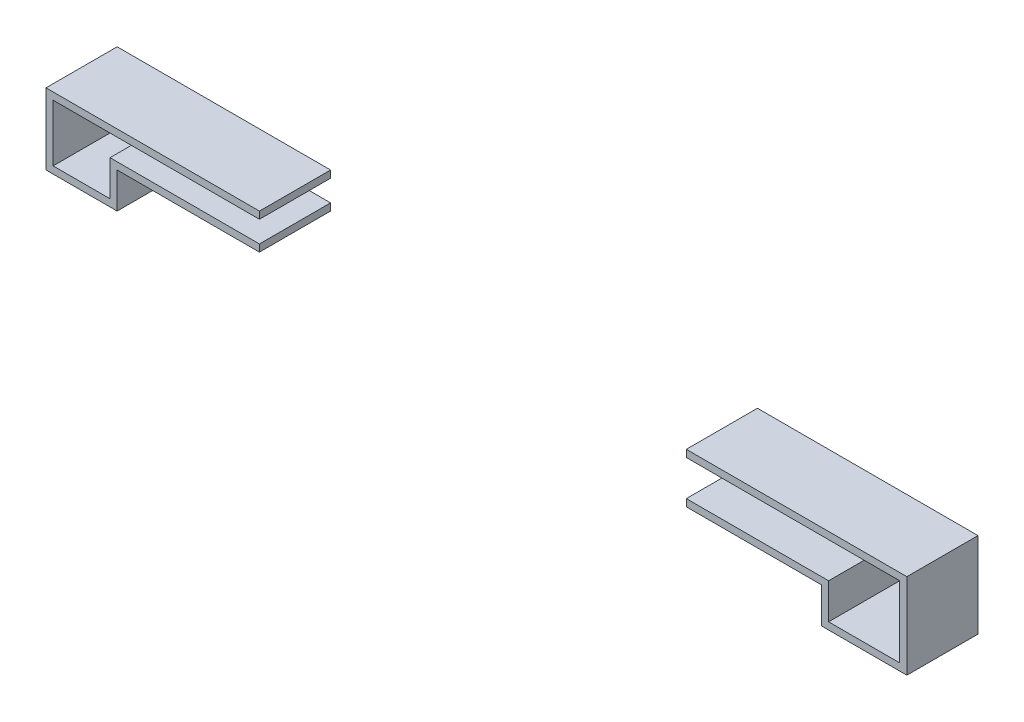
ISO-10303-21;
HEADER;
FILE_DESCRIPTION(('STEP AP214'),'2;1');
FILE_NAME('part.step','',(''),(''),'','','');
FILE_SCHEMA(('AUTOMOTIVE_DESIGN { 1 0 10303 214 1 1 1 1 }'));
ENDSEC;
DATA;
#1=APPLICATION_CONTEXT('core data for automotive mechanical design processes');
#2=APPLICATION_PROTOCOL_DEFINITION('international standard','automotive_design',2000,#1);
#3=PRODUCT_CONTEXT('',#1,'mechanical');
#4=PRODUCT('Part','Part','',(#3));
#5=PRODUCT_RELATED_PRODUCT_CATEGORY('part','',(#4));
#6=PRODUCT_DEFINITION_FORMATION('','',#4);
#7=PRODUCT_DEFINITION_CONTEXT('part definition',#1,'design');
#8=PRODUCT_DEFINITION('design','',#6,#7);
#9=PRODUCT_DEFINITION_SHAPE('','',#8);
#10=(LENGTH_UNIT() NAMED_UNIT(*) SI_UNIT(.MILLI.,.METRE.));
#11=(NAMED_UNIT(*) PLANE_ANGLE_UNIT() SI_UNIT($,.RADIAN.));
#12=(NAMED_UNIT(*) SI_UNIT($,.STERADIAN.) SOLID_ANGLE_UNIT());
#13=UNCERTAINTY_MEASURE_WITH_UNIT(LENGTH_MEASURE(1.E-05),#10,'distance_accuracy_value','');
#14=(GEOMETRIC_REPRESENTATION_CONTEXT(3) GLOBAL_UNCERTAINTY_ASSIGNED_CONTEXT((#13)) GLOBAL_UNIT_ASSIGNED_CONTEXT((#10,
#11,#12)) REPRESENTATION_CONTEXT('',''));
#15=CARTESIAN_POINT('',(0.,0.,0.));
#16=DIRECTION('',(0.,0.,1.));
#17=DIRECTION('',(1.,0.,0.));
#18=AXIS2_PLACEMENT_3D('',#15,#16,#17);
#19=CARTESIAN_POINT('',(6.,1.1,1.));
#20=DIRECTION('',(0.,-1.,0.));
#21=DIRECTION('',(1.,0.,0.));
#22=AXIS2_PLACEMENT_3D('',#19,#20,#21);
#23=PLANE('',#22);
#24=DIRECTION('',(-1.,0.,0.));
#25=VECTOR('',#24,1.);
#26=CARTESIAN_POINT('',(6.,1.1,0.));
#27=LINE('',#26,#25);
#28=CARTESIAN_POINT('',(6.1,1.1,0.));
#29=VERTEX_POINT('',#28);
#30=CARTESIAN_POINT('',(3.,1.1,0.));
#31=VERTEX_POINT('',#30);
#32=EDGE_CURVE('E178',#29,#31,#27,.T.);
#33=ORIENTED_EDGE('',*,*,#32,.T.);
#34=DIRECTION('',(0.,0.,-1.));
#35=VECTOR('',#34,1.);
#36=CARTESIAN_POINT('',(3.,1.1,1.));
#37=LINE('',#36,#35);
#38=CARTESIAN_POINT('',(3.,1.1,1.));
#39=VERTEX_POINT('',#38);
#40=EDGE_CURVE('E12',#39,#31,#37,.T.);
#41=ORIENTED_EDGE('',*,*,#40,.F.);
#42=DIRECTION('',(-1.,0.,0.));
#43=VECTOR('',#42,1.);
#44=CARTESIAN_POINT('',(6.,1.1,1.));
#45=LINE('',#44,#43);
#46=CARTESIAN_POINT('',(6.1,1.1,1.));
#47=VERTEX_POINT('',#46);
#48=EDGE_CURVE('E122',#47,#39,#45,.T.);
#49=ORIENTED_EDGE('',*,*,#48,.F.);
#50=DIRECTION('',(0.,0.,-1.));
#51=VECTOR('',#50,1.);
#52=CARTESIAN_POINT('',(6.1,1.1,1.));
#53=LINE('',#52,#51);
#54=EDGE_CURVE('E174',#47,#29,#53,.T.);
#55=ORIENTED_EDGE('',*,*,#54,.T.);
#56=EDGE_LOOP('',(#33,#41,#49,#55));
#57=FACE_BOUND('',#56,.T.);
#58=ADVANCED_FACE('F53',(#57),#23,.F.);
#59=CARTESIAN_POINT('',(3.,1.,1.));
#60=DIRECTION('',(-1.,0.,0.));
#61=DIRECTION('',(0.,0.,1.));
#62=AXIS2_PLACEMENT_3D('',#59,#60,#61);
#63=PLANE('',#62);
#64=DIRECTION('',(0.,1.,0.));
#65=VECTOR('',#64,1.);
#66=CARTESIAN_POINT('',(3.,1.,0.));
#67=LINE('',#66,#65);
#68=CARTESIAN_POINT('',(3.,1.,0.));
#69=VERTEX_POINT('',#68);
#70=EDGE_CURVE('E182',#69,#31,#67,.T.);
#71=ORIENTED_EDGE('',*,*,#70,.F.);
#72=DIRECTION('',(0.,0.,-1.));
#73=VECTOR('',#72,1.);
#74=CARTESIAN_POINT('',(3.,1.,1.));
#75=LINE('',#74,#73);
#76=CARTESIAN_POINT('',(3.,1.,1.));
#77=VERTEX_POINT('',#76);
#78=EDGE_CURVE('E62',#77,#69,#75,.T.);
#79=ORIENTED_EDGE('',*,*,#78,.F.);
#80=DIRECTION('',(0.,1.,0.));
#81=VECTOR('',#80,1.);
#82=CARTESIAN_POINT('',(3.,1.,1.));
#83=LINE('',#82,#81);
#84=EDGE_CURVE('E265',#77,#39,#83,.T.);
#85=ORIENTED_EDGE('',*,*,#84,.T.);
#86=ORIENTED_EDGE('',*,*,#40,.T.);
#87=EDGE_LOOP('',(#71,#79,#85,#86));
#88=FACE_BOUND('',#87,.T.);
#89=ADVANCED_FACE('F252',(#88),#63,.T.);
#90=CARTESIAN_POINT('',(6.,1.,1.));
#91=DIRECTION('',(0.,-1.,0.));
#92=DIRECTION('',(1.,0.,0.));
#93=AXIS2_PLACEMENT_3D('',#90,#91,#92);
#94=PLANE('',#93);
#95=DIRECTION('',(-1.,0.,0.));
#96=VECTOR('',#95,1.);
#97=CARTESIAN_POINT('',(6.,1.,0.));
#98=LINE('',#97,#96);
#99=CARTESIAN_POINT('',(6.,1.,0.));
#100=VERTEX_POINT('',#99);
#101=EDGE_CURVE('E186',#100,#69,#98,.T.);
#102=ORIENTED_EDGE('',*,*,#101,.F.);
#103=DIRECTION('',(0.,0.,-1.));
#104=VECTOR('',#103,1.);
#105=CARTESIAN_POINT('',(6.,1.,1.));
#106=LINE('',#105,#104);
#107=CARTESIAN_POINT('',(6.,1.,1.));
#108=VERTEX_POINT('',#107);
#109=EDGE_CURVE('E240',#108,#100,#106,.T.);
#110=ORIENTED_EDGE('',*,*,#109,.F.);
#111=DIRECTION('',(-1.,0.,0.));
#112=VECTOR('',#111,1.);
#113=CARTESIAN_POINT('',(6.,1.,1.));
#114=LINE('',#113,#112);
#115=EDGE_CURVE('E249',#108,#77,#114,.T.);
#116=ORIENTED_EDGE('',*,*,#115,.T.);
#117=ORIENTED_EDGE('',*,*,#78,.T.);
#118=EDGE_LOOP('',(#102,#110,#116,#117));
#119=FACE_BOUND('',#118,.T.);
#120=ADVANCED_FACE('F247',(#119),#94,.T.);
#121=CARTESIAN_POINT('',(6.,0.,1.));
#122=DIRECTION('',(-1.,0.,0.));
#123=DIRECTION('',(0.,0.,1.));
#124=AXIS2_PLACEMENT_3D('',#121,#122,#123);
#125=PLANE('',#124);
#126=DIRECTION('',(0.,1.,0.));
#127=VECTOR('',#126,1.);
#128=CARTESIAN_POINT('',(6.,0.,0.));
#129=LINE('',#128,#127);
#130=CARTESIAN_POINT('',(6.,0.,0.));
#131=VERTEX_POINT('',#130);
#132=EDGE_CURVE('E190',#131,#100,#129,.T.);
#133=ORIENTED_EDGE('',*,*,#132,.F.);
#134=DIRECTION('',(0.,0.,-1.));
#135=VECTOR('',#134,1.);
#136=CARTESIAN_POINT('',(6.,0.,1.));
#137=LINE('',#136,#135);
#138=CARTESIAN_POINT('',(6.,0.,1.));
#139=VERTEX_POINT('',#138);
#140=EDGE_CURVE('E237',#139,#131,#137,.T.);
#141=ORIENTED_EDGE('',*,*,#140,.F.);
#142=DIRECTION('',(0.,1.,0.));
#143=VECTOR('',#142,1.);
#144=CARTESIAN_POINT('',(6.,0.,1.));
#145=LINE('',#144,#143);
#146=EDGE_CURVE('E262',#139,#108,#145,.T.);
#147=ORIENTED_EDGE('',*,*,#146,.T.);
#148=ORIENTED_EDGE('',*,*,#109,.T.);
#149=EDGE_LOOP('',(#133,#141,#147,#148));
#150=FACE_BOUND('',#149,.T.);
#151=ADVANCED_FACE('F259',(#150),#125,.T.);
#152=CARTESIAN_POINT('',(5.,0.,1.));
#153=DIRECTION('',(0.,1.,0.));
#154=DIRECTION('',(0.,0.,1.));
#155=AXIS2_PLACEMENT_3D('',#152,#153,#154);
#156=PLANE('',#155);
#157=DIRECTION('',(1.,0.,0.));
#158=VECTOR('',#157,1.);
#159=CARTESIAN_POINT('',(5.,0.,0.));
#160=LINE('',#159,#158);
#161=CARTESIAN_POINT('',(5.,0.,0.));
#162=VERTEX_POINT('',#161);
#163=EDGE_CURVE('E194',#162,#131,#160,.T.);
#164=ORIENTED_EDGE('',*,*,#163,.F.);
#165=DIRECTION('',(0.,0.,-1.));
#166=VECTOR('',#165,1.);
#167=CARTESIAN_POINT('',(5.,0.,1.));
#168=LINE('',#167,#166);
#169=CARTESIAN_POINT('',(5.,0.,1.));
#170=VERTEX_POINT('',#169);
#171=EDGE_CURVE('E234',#170,#162,#168,.T.);
#172=ORIENTED_EDGE('',*,*,#171,.F.);
#173=DIRECTION('',(1.,0.,0.));
#174=VECTOR('',#173,1.);
#175=CARTESIAN_POINT('',(5.,0.,1.));
#176=LINE('',#175,#174);
#177=EDGE_CURVE('E270',#170,#139,#176,.T.);
#178=ORIENTED_EDGE('',*,*,#177,.T.);
#179=ORIENTED_EDGE('',*,*,#140,.T.);
#180=EDGE_LOOP('',(#164,#172,#178,#179));
#181=FACE_BOUND('',#180,.T.);
#182=ADVANCED_FACE('F382',(#181),#156,.T.);
#183=CARTESIAN_POINT('',(5.,0.,1.));
#184=DIRECTION('',(1.,0.,0.));
#185=DIRECTION('',(0.,0.,-1.));
#186=AXIS2_PLACEMENT_3D('',#183,#184,#185);
#187=PLANE('',#186);
#188=DIRECTION('',(0.,-1.,0.));
#189=VECTOR('',#188,1.);
#190=CARTESIAN_POINT('',(5.,0.,0.));
#191=LINE('',#190,#189);
#192=CARTESIAN_POINT('',(5.,0.500000000000001,0.));
#193=VERTEX_POINT('',#192);
#194=EDGE_CURVE('E198',#193,#162,#191,.T.);
#195=ORIENTED_EDGE('',*,*,#194,.F.);
#196=DIRECTION('',(0.,0.,-1.));
#197=VECTOR('',#196,1.);
#198=CARTESIAN_POINT('',(5.,0.500000000000001,1.));
#199=LINE('',#198,#197);
#200=CARTESIAN_POINT('',(5.,0.500000000000001,1.));
#201=VERTEX_POINT('',#200);
#202=EDGE_CURVE('E231',#201,#193,#199,.T.);
#203=ORIENTED_EDGE('',*,*,#202,.F.);
#204=DIRECTION('',(0.,-1.,0.));
#205=VECTOR('',#204,1.);
#206=CARTESIAN_POINT('',(5.,0.,1.));
#207=LINE('',#206,#205);
#208=EDGE_CURVE('E277',#201,#170,#207,.T.);
#209=ORIENTED_EDGE('',*,*,#208,.T.);
#210=ORIENTED_EDGE('',*,*,#171,.T.);
#211=EDGE_LOOP('',(#195,#203,#209,#210));
#212=FACE_BOUND('',#211,.T.);
#213=ADVANCED_FACE('F372',(#212),#187,.T.);
#214=CARTESIAN_POINT('',(5.,0.500000000000001,1.));
#215=DIRECTION('',(0.,1.,0.));
#216=DIRECTION('',(-1.,0.,0.));
#217=AXIS2_PLACEMENT_3D('',#214,#215,#216);
#218=PLANE('',#217);
#219=DIRECTION('',(1.,0.,0.));
#220=VECTOR('',#219,1.);
#221=CARTESIAN_POINT('',(5.,0.500000000000001,0.));
#222=LINE('',#221,#220);
#223=CARTESIAN_POINT('',(3.,0.5,0.));
#224=VERTEX_POINT('',#223);
#225=EDGE_CURVE('E202',#224,#193,#222,.T.);
#226=ORIENTED_EDGE('',*,*,#225,.F.);
#227=DIRECTION('',(0.,0.,-1.));
#228=VECTOR('',#227,1.);
#229=CARTESIAN_POINT('',(3.,0.5,1.));
#230=LINE('',#229,#228);
#231=CARTESIAN_POINT('',(3.,0.5,1.));
#232=VERTEX_POINT('',#231);
#233=EDGE_CURVE('E228',#232,#224,#230,.T.);
#234=ORIENTED_EDGE('',*,*,#233,.F.);
#235=DIRECTION('',(1.,0.,0.));
#236=VECTOR('',#235,1.);
#237=CARTESIAN_POINT('',(5.,0.500000000000001,1.));
#238=LINE('',#237,#236);
#239=EDGE_CURVE('E281',#232,#201,#238,.T.);
#240=ORIENTED_EDGE('',*,*,#239,.T.);
#241=ORIENTED_EDGE('',*,*,#202,.T.);
#242=EDGE_LOOP('',(#226,#234,#240,#241));
#243=FACE_BOUND('',#242,.T.);
#244=ADVANCED_FACE('F296',(#243),#218,.T.);
#245=CARTESIAN_POINT('',(3.,0.4,1.));
#246=DIRECTION('',(-1.,0.,0.));
#247=DIRECTION('',(0.,0.,1.));
#248=AXIS2_PLACEMENT_3D('',#245,#246,#247);
#249=PLANE('',#248);
#250=DIRECTION('',(0.,1.,0.));
#251=VECTOR('',#250,1.);
#252=CARTESIAN_POINT('',(3.,0.4,0.));
#253=LINE('',#252,#251);
#254=CARTESIAN_POINT('',(3.,0.4,0.));
#255=VERTEX_POINT('',#254);
#256=EDGE_CURVE('E206',#255,#224,#253,.T.);
#257=ORIENTED_EDGE('',*,*,#256,.F.);
#258=DIRECTION('',(0.,0.,-1.));
#259=VECTOR('',#258,1.);
#260=CARTESIAN_POINT('',(3.,0.4,1.));
#261=LINE('',#260,#259);
#262=CARTESIAN_POINT('',(3.,0.4,1.));
#263=VERTEX_POINT('',#262);
#264=EDGE_CURVE('E225',#263,#255,#261,.T.);
#265=ORIENTED_EDGE('',*,*,#264,.F.);
#266=DIRECTION('',(0.,1.,0.));
#267=VECTOR('',#266,1.);
#268=CARTESIAN_POINT('',(3.,0.4,1.));
#269=LINE('',#268,#267);
#270=EDGE_CURVE('E285',#263,#232,#269,.T.);
#271=ORIENTED_EDGE('',*,*,#270,.T.);
#272=ORIENTED_EDGE('',*,*,#233,.T.);
#273=EDGE_LOOP('',(#257,#265,#271,#272));
#274=FACE_BOUND('',#273,.T.);
#275=ADVANCED_FACE('F291',(#274),#249,.T.);
#276=CARTESIAN_POINT('',(5.,0.400000000000001,1.));
#277=DIRECTION('',(0.,1.,0.));
#278=DIRECTION('',(-1.,0.,0.));
#279=AXIS2_PLACEMENT_3D('',#276,#277,#278);
#280=PLANE('',#279);
#281=DIRECTION('',(1.,0.,0.));
#282=VECTOR('',#281,1.);
#283=CARTESIAN_POINT('',(5.,0.400000000000001,0.));
#284=LINE('',#283,#282);
#285=CARTESIAN_POINT('',(4.9,0.400000000000001,0.));
#286=VERTEX_POINT('',#285);
#287=EDGE_CURVE('E210',#255,#286,#284,.T.);
#288=ORIENTED_EDGE('',*,*,#287,.T.);
#289=DIRECTION('',(0.,0.,-1.));
#290=VECTOR('',#289,1.);
#291=CARTESIAN_POINT('',(4.9,0.400000000000001,1.));
#292=LINE('',#291,#290);
#293=CARTESIAN_POINT('',(4.9,0.400000000000001,1.));
#294=VERTEX_POINT('',#293);
#295=EDGE_CURVE('E167',#294,#286,#292,.T.);
#296=ORIENTED_EDGE('',*,*,#295,.F.);
#297=DIRECTION('',(1.,0.,0.));
#298=VECTOR('',#297,1.);
#299=CARTESIAN_POINT('',(5.,0.400000000000001,1.));
#300=LINE('',#299,#298);
#301=EDGE_CURVE('E156',#263,#294,#300,.T.);
#302=ORIENTED_EDGE('',*,*,#301,.F.);
#303=ORIENTED_EDGE('',*,*,#264,.T.);
#304=EDGE_LOOP('',(#288,#296,#302,#303));
#305=FACE_BOUND('',#304,.T.);
#306=ADVANCED_FACE('F300',(#305),#280,.F.);
#307=CARTESIAN_POINT('',(4.9,0.,1.));
#308=DIRECTION('',(1.,0.,0.));
#309=DIRECTION('',(0.,0.,-1.));
#310=AXIS2_PLACEMENT_3D('',#307,#308,#309);
#311=PLANE('',#310);
#312=DIRECTION('',(0.,1.,0.));
#313=VECTOR('',#312,1.);
#314=CARTESIAN_POINT('',(4.9,0.,0.));
#315=LINE('',#314,#313);
#316=CARTESIAN_POINT('',(4.9,-0.1,0.));
#317=VERTEX_POINT('',#316);
#318=EDGE_CURVE('E165',#286,#317,#315,.F.);
#319=ORIENTED_EDGE('',*,*,#318,.T.);
#320=DIRECTION('',(0.,0.,-1.));
#321=VECTOR('',#320,1.);
#322=CARTESIAN_POINT('',(4.9,-0.1,1.));
#323=LINE('',#322,#321);
#324=CARTESIAN_POINT('',(4.9,-0.1,1.));
#325=VERTEX_POINT('',#324);
#326=EDGE_CURVE('E162',#325,#317,#323,.T.);
#327=ORIENTED_EDGE('',*,*,#326,.F.);
#328=DIRECTION('',(0.,1.,0.));
#329=VECTOR('',#328,1.);
#330=CARTESIAN_POINT('',(4.9,0.,1.));
#331=LINE('',#330,#329);
#332=EDGE_CURVE('E149',#294,#325,#331,.F.);
#333=ORIENTED_EDGE('',*,*,#332,.F.);
#334=ORIENTED_EDGE('',*,*,#295,.T.);
#335=EDGE_LOOP('',(#319,#327,#333,#334));
#336=FACE_BOUND('',#335,.T.);
#337=ADVANCED_FACE('F163',(#336),#311,.F.);
#338=CARTESIAN_POINT('',(5.,-0.1,1.));
#339=DIRECTION('',(0.,1.,0.));
#340=DIRECTION('',(0.,0.,1.));
#341=AXIS2_PLACEMENT_3D('',#338,#339,#340);
#342=PLANE('',#341);
#343=DIRECTION('',(1.,0.,0.));
#344=VECTOR('',#343,1.);
#345=CARTESIAN_POINT('',(5.,-0.1,0.));
#346=LINE('',#345,#344);
#347=CARTESIAN_POINT('',(6.1,-0.1,0.));
#348=VERTEX_POINT('',#347);
#349=EDGE_CURVE('E110',#317,#348,#346,.T.);
#350=ORIENTED_EDGE('',*,*,#349,.T.);
#351=DIRECTION('',(0.,0.,-1.));
#352=VECTOR('',#351,1.);
#353=CARTESIAN_POINT('',(6.1,-0.1,1.));
#354=LINE('',#353,#352);
#355=CARTESIAN_POINT('',(6.1,-0.1,1.));
#356=VERTEX_POINT('',#355);
#357=EDGE_CURVE('E168',#356,#348,#354,.T.);
#358=ORIENTED_EDGE('',*,*,#357,.F.);
#359=DIRECTION('',(1.,0.,0.));
#360=VECTOR('',#359,1.);
#361=CARTESIAN_POINT('',(5.,-0.1,1.));
#362=LINE('',#361,#360);
#363=EDGE_CURVE('E153',#325,#356,#362,.T.);
#364=ORIENTED_EDGE('',*,*,#363,.F.);
#365=ORIENTED_EDGE('',*,*,#326,.T.);
#366=EDGE_LOOP('',(#350,#358,#364,#365));
#367=FACE_BOUND('',#366,.T.);
#368=ADVANCED_FACE('F170',(#367),#342,.F.);
#369=CARTESIAN_POINT('',(6.1,0.,1.));
#370=DIRECTION('',(-1.,0.,0.));
#371=DIRECTION('',(0.,0.,1.));
#372=AXIS2_PLACEMENT_3D('',#369,#370,#371);
#373=PLANE('',#372);
#374=DIRECTION('',(0.,1.,0.));
#375=VECTOR('',#374,1.);
#376=CARTESIAN_POINT('',(6.1,0.,0.));
#377=LINE('',#376,#375);
#378=EDGE_CURVE('E116',#348,#29,#377,.T.);
#379=ORIENTED_EDGE('',*,*,#378,.T.);
#380=ORIENTED_EDGE('',*,*,#54,.F.);
#381=DIRECTION('',(0.,1.,0.));
#382=VECTOR('',#381,1.);
#383=CARTESIAN_POINT('',(6.1,0.,1.));
#384=LINE('',#383,#382);
#385=EDGE_CURVE('E70',#356,#47,#384,.T.);
#386=ORIENTED_EDGE('',*,*,#385,.F.);
#387=ORIENTED_EDGE('',*,*,#357,.T.);
#388=EDGE_LOOP('',(#379,#380,#386,#387));
#389=FACE_BOUND('',#388,.T.);
#390=ADVANCED_FACE('F314',(#389),#373,.F.);
#391=CARTESIAN_POINT('',(0.,0.,1.));
#392=DIRECTION('',(0.,0.,-1.));
#393=DIRECTION('',(-1.,0.,0.));
#394=AXIS2_PLACEMENT_3D('',#391,#392,#393);
#395=PLANE('',#394);
#396=ORIENTED_EDGE('',*,*,#48,.T.);
#397=ORIENTED_EDGE('',*,*,#84,.F.);
#398=ORIENTED_EDGE('',*,*,#115,.F.);
#399=ORIENTED_EDGE('',*,*,#146,.F.);
#400=ORIENTED_EDGE('',*,*,#177,.F.);
#401=ORIENTED_EDGE('',*,*,#208,.F.);
#402=ORIENTED_EDGE('',*,*,#239,.F.);
#403=ORIENTED_EDGE('',*,*,#270,.F.);
#404=ORIENTED_EDGE('',*,*,#301,.T.);
#405=ORIENTED_EDGE('',*,*,#332,.T.);
#406=ORIENTED_EDGE('',*,*,#363,.T.);
#407=ORIENTED_EDGE('',*,*,#385,.T.);
#408=EDGE_LOOP('',(#396,#397,#398,#399,#400,#401,#402,#403,#404,#405,#406,#407));
#409=FACE_BOUND('',#408,.T.);
#410=ADVANCED_FACE('F151',(#409),#395,.F.);
#411=CARTESIAN_POINT('',(0.,0.,0.));
#412=DIRECTION('',(0.,0.,-1.));
#413=DIRECTION('',(-1.,0.,0.));
#414=AXIS2_PLACEMENT_3D('',#411,#412,#413);
#415=PLANE('',#414);
#416=ORIENTED_EDGE('',*,*,#32,.F.);
#417=ORIENTED_EDGE('',*,*,#378,.F.);
#418=ORIENTED_EDGE('',*,*,#349,.F.);
#419=ORIENTED_EDGE('',*,*,#318,.F.);
#420=ORIENTED_EDGE('',*,*,#287,.F.);
#421=ORIENTED_EDGE('',*,*,#256,.T.);
#422=ORIENTED_EDGE('',*,*,#225,.T.);
#423=ORIENTED_EDGE('',*,*,#194,.T.);
#424=ORIENTED_EDGE('',*,*,#163,.T.);
#425=ORIENTED_EDGE('',*,*,#132,.T.);
#426=ORIENTED_EDGE('',*,*,#101,.T.);
#427=ORIENTED_EDGE('',*,*,#70,.T.);
#428=EDGE_LOOP('',(#416,#417,#418,#419,#420,#421,#422,#423,#424,#425,#426,#427));
#429=FACE_BOUND('',#428,.T.);
#430=ADVANCED_FACE('F255',(#429),#415,.T.);
#431=CLOSED_SHELL('',(#58,#89,#120,#151,#182,#213,#244,#275,#306,#337,#368,#390,#410,#430));
#432=MANIFOLD_SOLID_BREP('B2',#431);
#433=CARTESIAN_POINT('',(-6.,0.9,1.));
#434=DIRECTION('',(0.,1.,0.));
#435=DIRECTION('',(0.,0.,1.));
#436=AXIS2_PLACEMENT_3D('',#433,#434,#435);
#437=PLANE('',#436);
#438=DIRECTION('',(1.,0.,0.));
#439=VECTOR('',#438,1.);
#440=CARTESIAN_POINT('',(-6.,0.9,0.));
#441=LINE('',#440,#439);
#442=CARTESIAN_POINT('',(-5.9,0.9,0.));
#443=VERTEX_POINT('',#442);
#444=CARTESIAN_POINT('',(-3.,0.9,0.));
#445=VERTEX_POINT('',#444);
#446=EDGE_CURVE('E569',#443,#445,#441,.T.);
#447=ORIENTED_EDGE('',*,*,#446,.T.);
#448=DIRECTION('',(0.,0.,-1.));
#449=VECTOR('',#448,1.);
#450=CARTESIAN_POINT('',(-3.,0.9,1.));
#451=LINE('',#450,#449);
#452=CARTESIAN_POINT('',(-3.,0.9,1.));
#453=VERTEX_POINT('',#452);
#454=EDGE_CURVE('E51',#453,#445,#451,.T.);
#455=ORIENTED_EDGE('',*,*,#454,.F.);
#456=DIRECTION('',(1.,0.,0.));
#457=VECTOR('',#456,1.);
#458=CARTESIAN_POINT('',(-6.,0.9,1.));
#459=LINE('',#458,#457);
#460=CARTESIAN_POINT('',(-5.9,0.9,1.));
#461=VERTEX_POINT('',#460);
#462=EDGE_CURVE('E517',#461,#453,#459,.T.);
#463=ORIENTED_EDGE('',*,*,#462,.F.);
#464=DIRECTION('',(0.,0.,-1.));
#465=VECTOR('',#464,1.);
#466=CARTESIAN_POINT('',(-5.9,0.9,1.));
#467=LINE('',#466,#465);
#468=EDGE_CURVE('E565',#461,#443,#467,.T.);
#469=ORIENTED_EDGE('',*,*,#468,.T.);
#470=EDGE_LOOP('',(#447,#455,#463,#469));
#471=FACE_BOUND('',#470,.T.);
#472=ADVANCED_FACE('F449',(#471),#437,.F.);
#473=CARTESIAN_POINT('',(-3.,1.,1.));
#474=DIRECTION('',(1.,0.,0.));
#475=DIRECTION('',(0.,0.,-1.));
#476=AXIS2_PLACEMENT_3D('',#473,#474,#475);
#477=PLANE('',#476);
#478=DIRECTION('',(0.,-1.,0.));
#479=VECTOR('',#478,1.);
#480=CARTESIAN_POINT('',(-3.,1.,0.));
#481=LINE('',#480,#479);
#482=CARTESIAN_POINT('',(-3.,1.,0.));
#483=VERTEX_POINT('',#482);
#484=EDGE_CURVE('E572',#483,#445,#481,.T.);
#485=ORIENTED_EDGE('',*,*,#484,.F.);
#486=DIRECTION('',(0.,0.,-1.));
#487=VECTOR('',#486,1.);
#488=CARTESIAN_POINT('',(-3.,1.,1.));
#489=LINE('',#488,#487);
#490=CARTESIAN_POINT('',(-3.,1.,1.));
#491=VERTEX_POINT('',#490);
#492=EDGE_CURVE('E457',#491,#483,#489,.T.);
#493=ORIENTED_EDGE('',*,*,#492,.F.);
#494=DIRECTION('',(0.,-1.,0.));
#495=VECTOR('',#494,1.);
#496=CARTESIAN_POINT('',(-3.,1.,1.));
#497=LINE('',#496,#495);
#498=EDGE_CURVE('E634',#491,#453,#497,.T.);
#499=ORIENTED_EDGE('',*,*,#498,.T.);
#500=ORIENTED_EDGE('',*,*,#454,.T.);
#501=EDGE_LOOP('',(#485,#493,#499,#500));
#502=FACE_BOUND('',#501,.T.);
#503=ADVANCED_FACE('F621',(#502),#477,.T.);
#504=CARTESIAN_POINT('',(-6.,1.,1.));
#505=DIRECTION('',(0.,1.,0.));
#506=DIRECTION('',(0.,0.,1.));
#507=AXIS2_PLACEMENT_3D('',#504,#505,#506);
#508=PLANE('',#507);
#509=DIRECTION('',(1.,0.,0.));
#510=VECTOR('',#509,1.);
#511=CARTESIAN_POINT('',(-6.,1.,0.));
#512=LINE('',#511,#510);
#513=CARTESIAN_POINT('',(-6.,1.,0.));
#514=VERTEX_POINT('',#513);
#515=EDGE_CURVE('E575',#514,#483,#512,.T.);
#516=ORIENTED_EDGE('',*,*,#515,.F.);
#517=DIRECTION('',(0.,0.,-1.));
#518=VECTOR('',#517,1.);
#519=CARTESIAN_POINT('',(-6.,1.,1.));
#520=LINE('',#519,#518);
#521=CARTESIAN_POINT('',(-6.,1.,1.));
#522=VERTEX_POINT('',#521);
#523=EDGE_CURVE('E611',#522,#514,#520,.T.);
#524=ORIENTED_EDGE('',*,*,#523,.F.);
#525=DIRECTION('',(1.,0.,0.));
#526=VECTOR('',#525,1.);
#527=CARTESIAN_POINT('',(-6.,1.,1.));
#528=LINE('',#527,#526);
#529=EDGE_CURVE('E618',#522,#491,#528,.T.);
#530=ORIENTED_EDGE('',*,*,#529,.T.);
#531=ORIENTED_EDGE('',*,*,#492,.T.);
#532=EDGE_LOOP('',(#516,#524,#530,#531));
#533=FACE_BOUND('',#532,.T.);
#534=ADVANCED_FACE('F616',(#533),#508,.T.);
#535=CARTESIAN_POINT('',(-6.,0.,1.));
#536=DIRECTION('',(-1.,0.,0.));
#537=DIRECTION('',(0.,0.,1.));
#538=AXIS2_PLACEMENT_3D('',#535,#536,#537);
#539=PLANE('',#538);
#540=DIRECTION('',(0.,1.,0.));
#541=VECTOR('',#540,1.);
#542=CARTESIAN_POINT('',(-6.,0.,0.));
#543=LINE('',#542,#541);
#544=CARTESIAN_POINT('',(-6.,0.,0.));
#545=VERTEX_POINT('',#544);
#546=EDGE_CURVE('E578',#545,#514,#543,.T.);
#547=ORIENTED_EDGE('',*,*,#546,.F.);
#548=DIRECTION('',(0.,0.,-1.));
#549=VECTOR('',#548,1.);
#550=CARTESIAN_POINT('',(-6.,0.,1.));
#551=LINE('',#550,#549);
#552=CARTESIAN_POINT('',(-6.,0.,1.));
#553=VERTEX_POINT('',#552);
#554=EDGE_CURVE('E609',#553,#545,#551,.T.);
#555=ORIENTED_EDGE('',*,*,#554,.F.);
#556=DIRECTION('',(0.,1.,0.));
#557=VECTOR('',#556,1.);
#558=CARTESIAN_POINT('',(-6.,0.,1.));
#559=LINE('',#558,#557);
#560=EDGE_CURVE('E631',#553,#522,#559,.T.);
#561=ORIENTED_EDGE('',*,*,#560,.T.);
#562=ORIENTED_EDGE('',*,*,#523,.T.);
#563=EDGE_LOOP('',(#547,#555,#561,#562));
#564=FACE_BOUND('',#563,.T.);
#565=ADVANCED_FACE('F628',(#564),#539,.T.);
#566=CARTESIAN_POINT('',(-6.,0.,1.));
#567=DIRECTION('',(0.,-1.,0.));
#568=DIRECTION('',(0.,0.,-1.));
#569=AXIS2_PLACEMENT_3D('',#566,#567,#568);
#570=PLANE('',#569);
#571=DIRECTION('',(-1.,0.,0.));
#572=VECTOR('',#571,1.);
#573=CARTESIAN_POINT('',(-6.,0.,0.));
#574=LINE('',#573,#572);
#575=CARTESIAN_POINT('',(-5.,0.,0.));
#576=VERTEX_POINT('',#575);
#577=EDGE_CURVE('E581',#576,#545,#574,.T.);
#578=ORIENTED_EDGE('',*,*,#577,.F.);
#579=DIRECTION('',(0.,0.,-1.));
#580=VECTOR('',#579,1.);
#581=CARTESIAN_POINT('',(-5.,0.,1.));
#582=LINE('',#581,#580);
#583=CARTESIAN_POINT('',(-5.,0.,1.));
#584=VERTEX_POINT('',#583);
#585=EDGE_CURVE('E607',#584,#576,#582,.T.);
#586=ORIENTED_EDGE('',*,*,#585,.F.);
#587=DIRECTION('',(-1.,0.,0.));
#588=VECTOR('',#587,1.);
#589=CARTESIAN_POINT('',(-6.,0.,1.));
#590=LINE('',#589,#588);
#591=EDGE_CURVE('E636',#584,#553,#590,.T.);
#592=ORIENTED_EDGE('',*,*,#591,.T.);
#593=ORIENTED_EDGE('',*,*,#554,.T.);
#594=EDGE_LOOP('',(#578,#586,#592,#593));
#595=FACE_BOUND('',#594,.T.);
#596=ADVANCED_FACE('F743',(#595),#570,.T.);
#597=CARTESIAN_POINT('',(-5.,0.,1.));
#598=DIRECTION('',(1.,0.,0.));
#599=DIRECTION('',(0.,0.,-1.));
#600=AXIS2_PLACEMENT_3D('',#597,#598,#599);
#601=PLANE('',#600);
#602=DIRECTION('',(0.,-1.,0.));
#603=VECTOR('',#602,1.);
#604=CARTESIAN_POINT('',(-5.,0.,0.));
#605=LINE('',#604,#603);
#606=CARTESIAN_POINT('',(-5.,0.5,0.));
#607=VERTEX_POINT('',#606);
#608=EDGE_CURVE('E584',#607,#576,#605,.T.);
#609=ORIENTED_EDGE('',*,*,#608,.F.);
#610=DIRECTION('',(0.,0.,-1.));
#611=VECTOR('',#610,1.);
#612=CARTESIAN_POINT('',(-5.,0.5,1.));
#613=LINE('',#612,#611);
#614=CARTESIAN_POINT('',(-5.,0.5,1.));
#615=VERTEX_POINT('',#614);
#616=EDGE_CURVE('E605',#615,#607,#613,.T.);
#617=ORIENTED_EDGE('',*,*,#616,.F.);
#618=DIRECTION('',(0.,-1.,0.));
#619=VECTOR('',#618,1.);
#620=CARTESIAN_POINT('',(-5.,0.,1.));
#621=LINE('',#620,#619);
#622=EDGE_CURVE('E642',#615,#584,#621,.T.);
#623=ORIENTED_EDGE('',*,*,#622,.T.);
#624=ORIENTED_EDGE('',*,*,#585,.T.);
#625=EDGE_LOOP('',(#609,#617,#623,#624));
#626=FACE_BOUND('',#625,.T.);
#627=ADVANCED_FACE('F733',(#626),#601,.T.);
#628=CARTESIAN_POINT('',(-5.,0.5,1.));
#629=DIRECTION('',(0.,-1.,0.));
#630=DIRECTION('',(0.,0.,-1.));
#631=AXIS2_PLACEMENT_3D('',#628,#629,#630);
#632=PLANE('',#631);
#633=DIRECTION('',(-1.,0.,0.));
#634=VECTOR('',#633,1.);
#635=CARTESIAN_POINT('',(-5.,0.5,0.));
#636=LINE('',#635,#634);
#637=CARTESIAN_POINT('',(-3.,0.5,0.));
#638=VERTEX_POINT('',#637);
#639=EDGE_CURVE('E587',#638,#607,#636,.T.);
#640=ORIENTED_EDGE('',*,*,#639,.F.);
#641=DIRECTION('',(0.,0.,-1.));
#642=VECTOR('',#641,1.);
#643=CARTESIAN_POINT('',(-3.,0.5,1.));
#644=LINE('',#643,#642);
#645=CARTESIAN_POINT('',(-3.,0.5,1.));
#646=VERTEX_POINT('',#645);
#647=EDGE_CURVE('E603',#646,#638,#644,.T.);
#648=ORIENTED_EDGE('',*,*,#647,.F.);
#649=DIRECTION('',(-1.,0.,0.));
#650=VECTOR('',#649,1.);
#651=CARTESIAN_POINT('',(-5.,0.5,1.));
#652=LINE('',#651,#650);
#653=EDGE_CURVE('E645',#646,#615,#652,.T.);
#654=ORIENTED_EDGE('',*,*,#653,.T.);
#655=ORIENTED_EDGE('',*,*,#616,.T.);
#656=EDGE_LOOP('',(#640,#648,#654,#655));
#657=FACE_BOUND('',#656,.T.);
#658=ADVANCED_FACE('F657',(#657),#632,.T.);
#659=CARTESIAN_POINT('',(-3.,0.6,1.));
#660=DIRECTION('',(1.,0.,0.));
#661=DIRECTION('',(0.,0.,-1.));
#662=AXIS2_PLACEMENT_3D('',#659,#660,#661);
#663=PLANE('',#662);
#664=DIRECTION('',(0.,-1.,0.));
#665=VECTOR('',#664,1.);
#666=CARTESIAN_POINT('',(-3.,0.6,0.));
#667=LINE('',#666,#665);
#668=CARTESIAN_POINT('',(-3.,0.6,0.));
#669=VERTEX_POINT('',#668);
#670=EDGE_CURVE('E590',#669,#638,#667,.T.);
#671=ORIENTED_EDGE('',*,*,#670,.F.);
#672=DIRECTION('',(0.,0.,-1.));
#673=VECTOR('',#672,1.);
#674=CARTESIAN_POINT('',(-3.,0.6,1.));
#675=LINE('',#674,#673);
#676=CARTESIAN_POINT('',(-3.,0.6,1.));
#677=VERTEX_POINT('',#676);
#678=EDGE_CURVE('E601',#677,#669,#675,.T.);
#679=ORIENTED_EDGE('',*,*,#678,.F.);
#680=DIRECTION('',(0.,-1.,0.));
#681=VECTOR('',#680,1.);
#682=CARTESIAN_POINT('',(-3.,0.6,1.));
#683=LINE('',#682,#681);
#684=EDGE_CURVE('E648',#677,#646,#683,.T.);
#685=ORIENTED_EDGE('',*,*,#684,.T.);
#686=ORIENTED_EDGE('',*,*,#647,.T.);
#687=EDGE_LOOP('',(#671,#679,#685,#686));
#688=FACE_BOUND('',#687,.T.);
#689=ADVANCED_FACE('F652',(#688),#663,.T.);
#690=CARTESIAN_POINT('',(-5.,0.6,1.));
#691=DIRECTION('',(0.,-1.,0.));
#692=DIRECTION('',(0.,0.,-1.));
#693=AXIS2_PLACEMENT_3D('',#690,#691,#692);
#694=PLANE('',#693);
#695=DIRECTION('',(1.,0.,0.));
#696=VECTOR('',#695,1.);
#697=CARTESIAN_POINT('',(-5.,0.6,0.));
#698=LINE('',#697,#696);
#699=CARTESIAN_POINT('',(-5.1,0.6,0.));
#700=VERTEX_POINT('',#699);
#701=EDGE_CURVE('E593',#669,#700,#698,.F.);
#702=ORIENTED_EDGE('',*,*,#701,.T.);
#703=DIRECTION('',(0.,0.,-1.));
#704=VECTOR('',#703,1.);
#705=CARTESIAN_POINT('',(-5.1,0.6,1.));
#706=LINE('',#705,#704);
#707=CARTESIAN_POINT('',(-5.1,0.6,1.));
#708=VERTEX_POINT('',#707);
#709=EDGE_CURVE('E560',#708,#700,#706,.T.);
#710=ORIENTED_EDGE('',*,*,#709,.F.);
#711=DIRECTION('',(1.,0.,0.));
#712=VECTOR('',#711,1.);
#713=CARTESIAN_POINT('',(-5.,0.6,1.));
#714=LINE('',#713,#712);
#715=EDGE_CURVE('E551',#677,#708,#714,.F.);
#716=ORIENTED_EDGE('',*,*,#715,.F.);
#717=ORIENTED_EDGE('',*,*,#678,.T.);
#718=EDGE_LOOP('',(#702,#710,#716,#717));
#719=FACE_BOUND('',#718,.T.);
#720=ADVANCED_FACE('F661',(#719),#694,.F.);
#721=CARTESIAN_POINT('',(-5.1,0.,1.));
#722=DIRECTION('',(1.,0.,0.));
#723=DIRECTION('',(0.,0.,-1.));
#724=AXIS2_PLACEMENT_3D('',#721,#722,#723);
#725=PLANE('',#724);
#726=DIRECTION('',(0.,1.,0.));
#727=VECTOR('',#726,1.);
#728=CARTESIAN_POINT('',(-5.1,0.,0.));
#729=LINE('',#728,#727);
#730=CARTESIAN_POINT('',(-5.1,0.1,0.));
#731=VERTEX_POINT('',#730);
#732=EDGE_CURVE('E559',#700,#731,#729,.F.);
#733=ORIENTED_EDGE('',*,*,#732,.T.);
#734=DIRECTION('',(0.,0.,-1.));
#735=VECTOR('',#734,1.);
#736=CARTESIAN_POINT('',(-5.1,0.1,1.));
#737=LINE('',#736,#735);
#738=CARTESIAN_POINT('',(-5.1,0.1,1.));
#739=VERTEX_POINT('',#738);
#740=EDGE_CURVE('E556',#739,#731,#737,.T.);
#741=ORIENTED_EDGE('',*,*,#740,.F.);
#742=DIRECTION('',(0.,1.,0.));
#743=VECTOR('',#742,1.);
#744=CARTESIAN_POINT('',(-5.1,0.,1.));
#745=LINE('',#744,#743);
#746=EDGE_CURVE('E544',#708,#739,#745,.F.);
#747=ORIENTED_EDGE('',*,*,#746,.F.);
#748=ORIENTED_EDGE('',*,*,#709,.T.);
#749=EDGE_LOOP('',(#733,#741,#747,#748));
#750=FACE_BOUND('',#749,.T.);
#751=ADVANCED_FACE('F557',(#750),#725,.F.);
#752=CARTESIAN_POINT('',(-6.,0.1,1.));
#753=DIRECTION('',(0.,-1.,0.));
#754=DIRECTION('',(0.,0.,-1.));
#755=AXIS2_PLACEMENT_3D('',#752,#753,#754);
#756=PLANE('',#755);
#757=DIRECTION('',(1.,0.,0.));
#758=VECTOR('',#757,1.);
#759=CARTESIAN_POINT('',(-6.,0.1,0.));
#760=LINE('',#759,#758);
#761=CARTESIAN_POINT('',(-5.9,0.1,0.));
#762=VERTEX_POINT('',#761);
#763=EDGE_CURVE('E505',#731,#762,#760,.F.);
#764=ORIENTED_EDGE('',*,*,#763,.T.);
#765=DIRECTION('',(0.,0.,-1.));
#766=VECTOR('',#765,1.);
#767=CARTESIAN_POINT('',(-5.9,0.1,1.));
#768=LINE('',#767,#766);
#769=CARTESIAN_POINT('',(-5.9,0.1,1.));
#770=VERTEX_POINT('',#769);
#771=EDGE_CURVE('E561',#770,#762,#768,.T.);
#772=ORIENTED_EDGE('',*,*,#771,.F.);
#773=DIRECTION('',(1.,0.,0.));
#774=VECTOR('',#773,1.);
#775=CARTESIAN_POINT('',(-6.,0.1,1.));
#776=LINE('',#775,#774);
#777=EDGE_CURVE('E548',#739,#770,#776,.F.);
#778=ORIENTED_EDGE('',*,*,#777,.F.);
#779=ORIENTED_EDGE('',*,*,#740,.T.);
#780=EDGE_LOOP('',(#764,#772,#778,#779));
#781=FACE_BOUND('',#780,.T.);
#782=ADVANCED_FACE('F563',(#781),#756,.F.);
#783=CARTESIAN_POINT('',(-5.9,0.,1.));
#784=DIRECTION('',(-1.,0.,0.));
#785=DIRECTION('',(0.,0.,1.));
#786=AXIS2_PLACEMENT_3D('',#783,#784,#785);
#787=PLANE('',#786);
#788=DIRECTION('',(0.,1.,0.));
#789=VECTOR('',#788,1.);
#790=CARTESIAN_POINT('',(-5.9,0.,0.));
#791=LINE('',#790,#789);
#792=EDGE_CURVE('E511',#762,#443,#791,.T.);
#793=ORIENTED_EDGE('',*,*,#792,.T.);
#794=ORIENTED_EDGE('',*,*,#468,.F.);
#795=DIRECTION('',(0.,1.,0.));
#796=VECTOR('',#795,1.);
#797=CARTESIAN_POINT('',(-5.9,0.,1.));
#798=LINE('',#797,#796);
#799=EDGE_CURVE('E465',#770,#461,#798,.T.);
#800=ORIENTED_EDGE('',*,*,#799,.F.);
#801=ORIENTED_EDGE('',*,*,#771,.T.);
#802=EDGE_LOOP('',(#793,#794,#800,#801));
#803=FACE_BOUND('',#802,.T.);
#804=ADVANCED_FACE('F675',(#803),#787,.F.);
#805=CARTESIAN_POINT('',(0.,0.,1.));
#806=DIRECTION('',(0.,0.,-1.));
#807=DIRECTION('',(-1.,0.,0.));
#808=AXIS2_PLACEMENT_3D('',#805,#806,#807);
#809=PLANE('',#808);
#810=ORIENTED_EDGE('',*,*,#462,.T.);
#811=ORIENTED_EDGE('',*,*,#498,.F.);
#812=ORIENTED_EDGE('',*,*,#529,.F.);
#813=ORIENTED_EDGE('',*,*,#560,.F.);
#814=ORIENTED_EDGE('',*,*,#591,.F.);
#815=ORIENTED_EDGE('',*,*,#622,.F.);
#816=ORIENTED_EDGE('',*,*,#653,.F.);
#817=ORIENTED_EDGE('',*,*,#684,.F.);
#818=ORIENTED_EDGE('',*,*,#715,.T.);
#819=ORIENTED_EDGE('',*,*,#746,.T.);
#820=ORIENTED_EDGE('',*,*,#777,.T.);
#821=ORIENTED_EDGE('',*,*,#799,.T.);
#822=EDGE_LOOP('',(#810,#811,#812,#813,#814,#815,#816,#817,#818,#819,#820,#821));
#823=FACE_BOUND('',#822,.T.);
#824=ADVANCED_FACE('F546',(#823),#809,.F.);
#825=CARTESIAN_POINT('',(0.,0.,0.));
#826=DIRECTION('',(0.,0.,-1.));
#827=DIRECTION('',(-1.,0.,0.));
#828=AXIS2_PLACEMENT_3D('',#825,#826,#827);
#829=PLANE('',#828);
#830=ORIENTED_EDGE('',*,*,#446,.F.);
#831=ORIENTED_EDGE('',*,*,#792,.F.);
#832=ORIENTED_EDGE('',*,*,#763,.F.);
#833=ORIENTED_EDGE('',*,*,#732,.F.);
#834=ORIENTED_EDGE('',*,*,#701,.F.);
#835=ORIENTED_EDGE('',*,*,#670,.T.);
#836=ORIENTED_EDGE('',*,*,#639,.T.);
#837=ORIENTED_EDGE('',*,*,#608,.T.);
#838=ORIENTED_EDGE('',*,*,#577,.T.);
#839=ORIENTED_EDGE('',*,*,#546,.T.);
#840=ORIENTED_EDGE('',*,*,#515,.T.);
#841=ORIENTED_EDGE('',*,*,#484,.T.);
#842=EDGE_LOOP('',(#830,#831,#832,#833,#834,#835,#836,#837,#838,#839,#840,#841));
#843=FACE_BOUND('',#842,.T.);
#844=ADVANCED_FACE('F624',(#843),#829,.T.);
#845=CLOSED_SHELL('',(#472,#503,#534,#565,#596,#627,#658,#689,#720,#751,#782,#804,#824,#844));
#846=MANIFOLD_SOLID_BREP('B6',#845);
#847=ADVANCED_BREP_SHAPE_REPRESENTATION('',(#18,#432,#846),#14);
#848=SHAPE_DEFINITION_REPRESENTATION(#9,#847);
ENDSEC;
END-ISO-10303-21;
